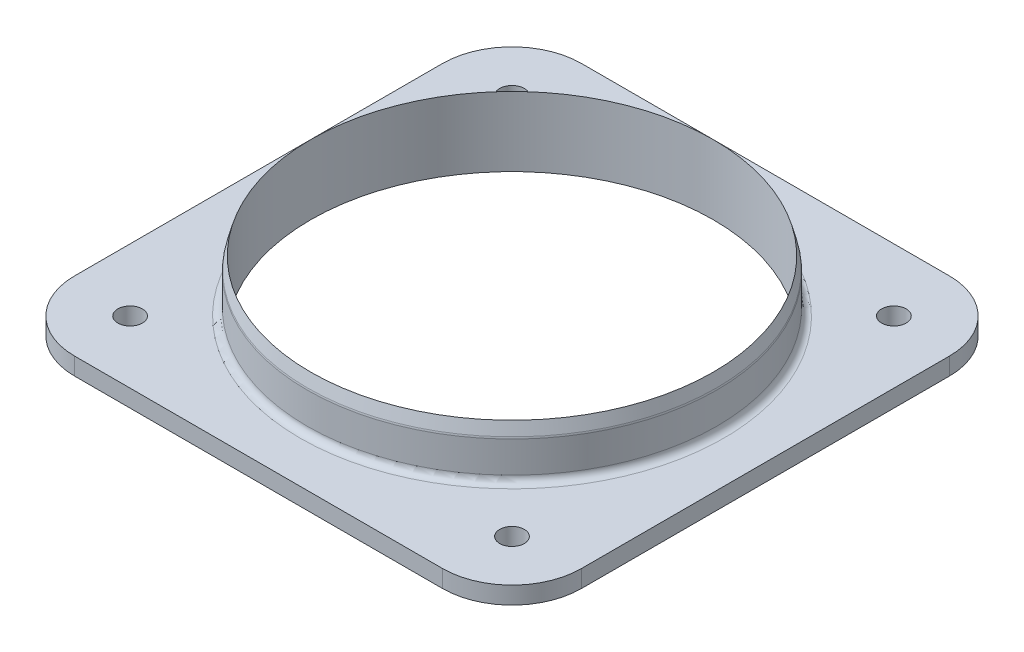
ISO-10303-21;
HEADER;
FILE_DESCRIPTION(('STEP AP214'),'2;1');
FILE_NAME('part.step','',(''),(''),'','','');
FILE_SCHEMA(('AUTOMOTIVE_DESIGN { 1 0 10303 214 1 1 1 1 }'));
ENDSEC;
DATA;
#1=APPLICATION_CONTEXT('core data for automotive mechanical design processes');
#2=APPLICATION_PROTOCOL_DEFINITION('international standard','automotive_design',2000,#1);
#3=PRODUCT_CONTEXT('',#1,'mechanical');
#4=PRODUCT('Part','Part','',(#3));
#5=PRODUCT_RELATED_PRODUCT_CATEGORY('part','',(#4));
#6=PRODUCT_DEFINITION_FORMATION('','',#4);
#7=PRODUCT_DEFINITION_CONTEXT('part definition',#1,'design');
#8=PRODUCT_DEFINITION('design','',#6,#7);
#9=PRODUCT_DEFINITION_SHAPE('','',#8);
#10=(LENGTH_UNIT() NAMED_UNIT(*) SI_UNIT(.MILLI.,.METRE.));
#11=(NAMED_UNIT(*) PLANE_ANGLE_UNIT() SI_UNIT($,.RADIAN.));
#12=(NAMED_UNIT(*) SI_UNIT($,.STERADIAN.) SOLID_ANGLE_UNIT());
#13=UNCERTAINTY_MEASURE_WITH_UNIT(LENGTH_MEASURE(1.E-05),#10,'distance_accuracy_value','');
#14=(GEOMETRIC_REPRESENTATION_CONTEXT(3) GLOBAL_UNCERTAINTY_ASSIGNED_CONTEXT((#13)) GLOBAL_UNIT_ASSIGNED_CONTEXT((#10,
#11,#12)) REPRESENTATION_CONTEXT('',''));
#15=CARTESIAN_POINT('',(0.,0.,0.));
#16=DIRECTION('',(0.,0.,1.));
#17=DIRECTION('',(1.,0.,0.));
#18=AXIS2_PLACEMENT_3D('',#15,#16,#17);
#19=CARTESIAN_POINT('',(0.,3.175,0.));
#20=DIRECTION('',(0.,1.,0.));
#21=DIRECTION('',(0.,0.,1.));
#22=AXIS2_PLACEMENT_3D('',#19,#20,#21);
#23=PLANE('',#22);
#24=CARTESIAN_POINT('',(0.,3.175,0.));
#25=DIRECTION('',(0.,1.,0.));
#26=DIRECTION('',(0.,0.,1.));
#27=AXIS2_PLACEMENT_3D('',#24,#25,#26);
#28=CIRCLE('',#27,38.735);
#29=CARTESIAN_POINT('',(0.,3.175,38.735));
#30=VERTEX_POINT('',#29);
#31=EDGE_CURVE('E11',#30,#30,#28,.F.);
#32=ORIENTED_EDGE('',*,*,#31,.T.);
#33=EDGE_LOOP('',(#32));
#34=FACE_BOUND('',#33,.T.);
#35=DIRECTION('',(-1.,0.,0.));
#36=VECTOR('',#35,1.);
#37=CARTESIAN_POINT('',(46.355,3.175,-46.355));
#38=LINE('',#37,#36);
#39=CARTESIAN_POINT('',(33.655,3.175,-46.355));
#40=VERTEX_POINT('',#39);
#41=CARTESIAN_POINT('',(-33.655,3.175,-46.355));
#42=VERTEX_POINT('',#41);
#43=EDGE_CURVE('E138',#40,#42,#38,.T.);
#44=ORIENTED_EDGE('',*,*,#43,.T.);
#45=CARTESIAN_POINT('',(-33.655,3.175,-33.655));
#46=DIRECTION('',(0.,1.,0.));
#47=DIRECTION('',(0.,0.,1.));
#48=AXIS2_PLACEMENT_3D('',#45,#46,#47);
#49=CIRCLE('',#48,12.7);
#50=CARTESIAN_POINT('',(-46.355,3.175,-33.655));
#51=VERTEX_POINT('',#50);
#52=EDGE_CURVE('E157',#42,#51,#49,.T.);
#53=ORIENTED_EDGE('',*,*,#52,.T.);
#54=DIRECTION('',(0.,0.,1.));
#55=VECTOR('',#54,1.);
#56=CARTESIAN_POINT('',(-46.355,3.175,46.355));
#57=LINE('',#56,#55);
#58=CARTESIAN_POINT('',(-46.355,3.175,33.655));
#59=VERTEX_POINT('',#58);
#60=EDGE_CURVE('E121',#51,#59,#57,.T.);
#61=ORIENTED_EDGE('',*,*,#60,.T.);
#62=CARTESIAN_POINT('',(-33.655,3.175,33.655));
#63=DIRECTION('',(0.,1.,0.));
#64=DIRECTION('',(0.,0.,1.));
#65=AXIS2_PLACEMENT_3D('',#62,#63,#64);
#66=CIRCLE('',#65,12.7);
#67=CARTESIAN_POINT('',(-33.655,3.175,46.355));
#68=VERTEX_POINT('',#67);
#69=EDGE_CURVE('E155',#59,#68,#66,.T.);
#70=ORIENTED_EDGE('',*,*,#69,.T.);
#71=DIRECTION('',(1.,0.,0.));
#72=VECTOR('',#71,1.);
#73=CARTESIAN_POINT('',(46.355,3.175,46.355));
#74=LINE('',#73,#72);
#75=CARTESIAN_POINT('',(33.655,3.175,46.355));
#76=VERTEX_POINT('',#75);
#77=EDGE_CURVE('E236',#68,#76,#74,.T.);
#78=ORIENTED_EDGE('',*,*,#77,.T.);
#79=CARTESIAN_POINT('',(33.655,3.175,33.655));
#80=DIRECTION('',(0.,1.,0.));
#81=DIRECTION('',(0.,0.,1.));
#82=AXIS2_PLACEMENT_3D('',#79,#80,#81);
#83=CIRCLE('',#82,12.7);
#84=CARTESIAN_POINT('',(46.355,3.175,33.655));
#85=VERTEX_POINT('',#84);
#86=EDGE_CURVE('E56',#76,#85,#83,.T.);
#87=ORIENTED_EDGE('',*,*,#86,.T.);
#88=DIRECTION('',(0.,0.,-1.));
#89=VECTOR('',#88,1.);
#90=CARTESIAN_POINT('',(46.355,3.175,46.355));
#91=LINE('',#90,#89);
#92=CARTESIAN_POINT('',(46.355,3.175,-33.655));
#93=VERTEX_POINT('',#92);
#94=EDGE_CURVE('E237',#85,#93,#91,.T.);
#95=ORIENTED_EDGE('',*,*,#94,.T.);
#96=CARTESIAN_POINT('',(33.655,3.175,-33.655));
#97=DIRECTION('',(0.,1.,0.));
#98=DIRECTION('',(0.,0.,1.));
#99=AXIS2_PLACEMENT_3D('',#96,#97,#98);
#100=CIRCLE('',#99,12.7);
#101=EDGE_CURVE('E152',#93,#40,#100,.T.);
#102=ORIENTED_EDGE('',*,*,#101,.T.);
#103=EDGE_LOOP('',(#44,#53,#61,#70,#78,#87,#95,#102));
#104=FACE_BOUND('',#103,.T.);
#105=CARTESIAN_POINT('',(-34.925,3.175,-34.925));
#106=DIRECTION('',(0.,1.,0.));
#107=DIRECTION('',(0.,0.,1.));
#108=AXIS2_PLACEMENT_3D('',#105,#106,#107);
#109=CIRCLE('',#108,2.25);
#110=CARTESIAN_POINT('',(-34.925,3.175,-32.675));
#111=VERTEX_POINT('',#110);
#112=EDGE_CURVE('E203',#111,#111,#109,.T.);
#113=ORIENTED_EDGE('',*,*,#112,.F.);
#114=EDGE_LOOP('',(#113));
#115=FACE_BOUND('',#114,.T.);
#116=CARTESIAN_POINT('',(34.9250000000001,3.175,-34.9249999999999));
#117=DIRECTION('',(0.,1.,0.));
#118=DIRECTION('',(-1.,0.,0.));
#119=AXIS2_PLACEMENT_3D('',#116,#117,#118);
#120=CIRCLE('',#119,2.25);
#121=CARTESIAN_POINT('',(32.6750000000001,3.175,-34.9249999999999));
#122=VERTEX_POINT('',#121);
#123=EDGE_CURVE('E207',#122,#122,#120,.T.);
#124=ORIENTED_EDGE('',*,*,#123,.F.);
#125=EDGE_LOOP('',(#124));
#126=FACE_BOUND('',#125,.T.);
#127=CARTESIAN_POINT('',(34.925,3.175,34.925));
#128=DIRECTION('',(0.,1.,0.));
#129=DIRECTION('',(0.,0.,-1.));
#130=AXIS2_PLACEMENT_3D('',#127,#128,#129);
#131=CIRCLE('',#130,2.25);
#132=CARTESIAN_POINT('',(34.925,3.175,32.675));
#133=VERTEX_POINT('',#132);
#134=EDGE_CURVE('E211',#133,#133,#131,.T.);
#135=ORIENTED_EDGE('',*,*,#134,.F.);
#136=EDGE_LOOP('',(#135));
#137=FACE_BOUND('',#136,.T.);
#138=CARTESIAN_POINT('',(-34.9250000000004,3.175,34.9249999999996));
#139=DIRECTION('',(0.,1.,0.));
#140=DIRECTION('',(1.,0.,0.));
#141=AXIS2_PLACEMENT_3D('',#138,#139,#140);
#142=CIRCLE('',#141,2.25);
#143=CARTESIAN_POINT('',(-32.6750000000004,3.175,34.9249999999996));
#144=VERTEX_POINT('',#143);
#145=EDGE_CURVE('E214',#144,#144,#142,.T.);
#146=ORIENTED_EDGE('',*,*,#145,.F.);
#147=EDGE_LOOP('',(#146));
#148=FACE_BOUND('',#147,.T.);
#149=ADVANCED_FACE('F34',(#34,#104,#115,#126,#137,#148),#23,.T.);
#150=CARTESIAN_POINT('',(0.,0.,0.));
#151=DIRECTION('',(0.,1.,0.));
#152=DIRECTION('',(0.,0.,1.));
#153=AXIS2_PLACEMENT_3D('',#150,#151,#152);
#154=PLANE('',#153);
#155=CARTESIAN_POINT('',(-34.9250000000004,0.,34.9249999999996));
#156=DIRECTION('',(0.,1.,0.));
#157=DIRECTION('',(1.,0.,0.));
#158=AXIS2_PLACEMENT_3D('',#155,#156,#157);
#159=CIRCLE('',#158,2.25);
#160=CARTESIAN_POINT('',(-32.6750000000004,0.,34.9249999999996));
#161=VERTEX_POINT('',#160);
#162=EDGE_CURVE('E216',#161,#161,#159,.T.);
#163=ORIENTED_EDGE('',*,*,#162,.T.);
#164=EDGE_LOOP('',(#163));
#165=FACE_BOUND('',#164,.T.);
#166=CARTESIAN_POINT('',(34.925,0.,34.925));
#167=DIRECTION('',(0.,1.,0.));
#168=DIRECTION('',(0.,0.,-1.));
#169=AXIS2_PLACEMENT_3D('',#166,#167,#168);
#170=CIRCLE('',#169,2.25);
#171=CARTESIAN_POINT('',(34.925,0.,32.675));
#172=VERTEX_POINT('',#171);
#173=EDGE_CURVE('E224',#172,#172,#170,.T.);
#174=ORIENTED_EDGE('',*,*,#173,.T.);
#175=EDGE_LOOP('',(#174));
#176=FACE_BOUND('',#175,.T.);
#177=CARTESIAN_POINT('',(34.9250000000001,0.,-34.9249999999999));
#178=DIRECTION('',(0.,1.,0.));
#179=DIRECTION('',(-1.,0.,0.));
#180=AXIS2_PLACEMENT_3D('',#177,#178,#179);
#181=CIRCLE('',#180,2.25);
#182=CARTESIAN_POINT('',(32.6750000000001,0.,-34.9249999999999));
#183=VERTEX_POINT('',#182);
#184=EDGE_CURVE('E228',#183,#183,#181,.T.);
#185=ORIENTED_EDGE('',*,*,#184,.T.);
#186=EDGE_LOOP('',(#185));
#187=FACE_BOUND('',#186,.T.);
#188=CARTESIAN_POINT('',(-34.925,0.,-34.925));
#189=DIRECTION('',(0.,1.,0.));
#190=DIRECTION('',(0.,0.,1.));
#191=AXIS2_PLACEMENT_3D('',#188,#189,#190);
#192=CIRCLE('',#191,2.25);
#193=CARTESIAN_POINT('',(-34.925,0.,-32.675));
#194=VERTEX_POINT('',#193);
#195=EDGE_CURVE('E135',#194,#194,#192,.T.);
#196=ORIENTED_EDGE('',*,*,#195,.T.);
#197=EDGE_LOOP('',(#196));
#198=FACE_BOUND('',#197,.T.);
#199=DIRECTION('',(0.,0.,1.));
#200=VECTOR('',#199,1.);
#201=CARTESIAN_POINT('',(-46.355,0.,46.355));
#202=LINE('',#201,#200);
#203=CARTESIAN_POINT('',(-46.355,0.,-33.655));
#204=VERTEX_POINT('',#203);
#205=CARTESIAN_POINT('',(-46.355,0.,33.655));
#206=VERTEX_POINT('',#205);
#207=EDGE_CURVE('E118',#204,#206,#202,.T.);
#208=ORIENTED_EDGE('',*,*,#207,.F.);
#209=CARTESIAN_POINT('',(-33.655,0.,-33.655));
#210=DIRECTION('',(0.,1.,0.));
#211=DIRECTION('',(0.,0.,1.));
#212=AXIS2_PLACEMENT_3D('',#209,#210,#211);
#213=CIRCLE('',#212,12.7);
#214=CARTESIAN_POINT('',(-33.655,0.,-46.355));
#215=VERTEX_POINT('',#214);
#216=EDGE_CURVE('E101',#204,#215,#213,.F.);
#217=ORIENTED_EDGE('',*,*,#216,.T.);
#218=DIRECTION('',(-1.,0.,0.));
#219=VECTOR('',#218,1.);
#220=CARTESIAN_POINT('',(46.355,0.,-46.355));
#221=LINE('',#220,#219);
#222=CARTESIAN_POINT('',(33.655,0.,-46.355));
#223=VERTEX_POINT('',#222);
#224=EDGE_CURVE('E142',#223,#215,#221,.T.);
#225=ORIENTED_EDGE('',*,*,#224,.F.);
#226=CARTESIAN_POINT('',(33.655,0.,-33.655));
#227=DIRECTION('',(0.,1.,0.));
#228=DIRECTION('',(0.,0.,1.));
#229=AXIS2_PLACEMENT_3D('',#226,#227,#228);
#230=CIRCLE('',#229,12.7);
#231=CARTESIAN_POINT('',(46.355,0.,-33.655));
#232=VERTEX_POINT('',#231);
#233=EDGE_CURVE('E122',#223,#232,#230,.F.);
#234=ORIENTED_EDGE('',*,*,#233,.T.);
#235=DIRECTION('',(0.,0.,-1.));
#236=VECTOR('',#235,1.);
#237=CARTESIAN_POINT('',(46.355,0.,46.355));
#238=LINE('',#237,#236);
#239=CARTESIAN_POINT('',(46.355,0.,33.655));
#240=VERTEX_POINT('',#239);
#241=EDGE_CURVE('E132',#240,#232,#238,.T.);
#242=ORIENTED_EDGE('',*,*,#241,.F.);
#243=CARTESIAN_POINT('',(33.655,0.,33.655));
#244=DIRECTION('',(0.,1.,0.));
#245=DIRECTION('',(0.,0.,1.));
#246=AXIS2_PLACEMENT_3D('',#243,#244,#245);
#247=CIRCLE('',#246,12.7);
#248=CARTESIAN_POINT('',(33.655,0.,46.355));
#249=VERTEX_POINT('',#248);
#250=EDGE_CURVE('E146',#240,#249,#247,.F.);
#251=ORIENTED_EDGE('',*,*,#250,.T.);
#252=DIRECTION('',(1.,0.,0.));
#253=VECTOR('',#252,1.);
#254=CARTESIAN_POINT('',(46.355,0.,46.355));
#255=LINE('',#254,#253);
#256=CARTESIAN_POINT('',(-33.655,0.,46.355));
#257=VERTEX_POINT('',#256);
#258=EDGE_CURVE('E128',#257,#249,#255,.T.);
#259=ORIENTED_EDGE('',*,*,#258,.F.);
#260=CARTESIAN_POINT('',(-33.655,0.,33.655));
#261=DIRECTION('',(0.,1.,0.));
#262=DIRECTION('',(0.,0.,1.));
#263=AXIS2_PLACEMENT_3D('',#260,#261,#262);
#264=CIRCLE('',#263,12.7);
#265=EDGE_CURVE('E112',#257,#206,#264,.F.);
#266=ORIENTED_EDGE('',*,*,#265,.T.);
#267=EDGE_LOOP('',(#208,#217,#225,#234,#242,#251,#259,#266));
#268=FACE_BOUND('',#267,.T.);
#269=CARTESIAN_POINT('',(0.,0.,0.));
#270=DIRECTION('',(0.,1.,0.));
#271=DIRECTION('',(0.,0.,1.));
#272=AXIS2_PLACEMENT_3D('',#269,#270,#271);
#273=CIRCLE('',#272,36.83);
#274=CARTESIAN_POINT('',(0.,0.,36.83));
#275=VERTEX_POINT('',#274);
#276=EDGE_CURVE('E129',#275,#275,#273,.T.);
#277=ORIENTED_EDGE('',*,*,#276,.T.);
#278=EDGE_LOOP('',(#277));
#279=FACE_BOUND('',#278,.T.);
#280=ADVANCED_FACE('F125',(#165,#176,#187,#198,#268,#279),#154,.F.);
#281=CARTESIAN_POINT('',(-46.355,3.175,46.355));
#282=DIRECTION('',(1.,0.,0.));
#283=DIRECTION('',(0.,0.,-1.));
#284=AXIS2_PLACEMENT_3D('',#281,#282,#283);
#285=PLANE('',#284);
#286=ORIENTED_EDGE('',*,*,#60,.F.);
#287=DIRECTION('',(0.,-1.,0.));
#288=VECTOR('',#287,1.);
#289=CARTESIAN_POINT('',(-46.355,3.175,-33.655));
#290=LINE('',#289,#288);
#291=EDGE_CURVE('E105',#51,#204,#290,.T.);
#292=ORIENTED_EDGE('',*,*,#291,.T.);
#293=ORIENTED_EDGE('',*,*,#207,.T.);
#294=DIRECTION('',(0.,-1.,0.));
#295=VECTOR('',#294,1.);
#296=CARTESIAN_POINT('',(-46.355,3.175,33.655));
#297=LINE('',#296,#295);
#298=EDGE_CURVE('E123',#206,#59,#297,.F.);
#299=ORIENTED_EDGE('',*,*,#298,.T.);
#300=EDGE_LOOP('',(#286,#292,#293,#299));
#301=FACE_BOUND('',#300,.T.);
#302=ADVANCED_FACE('F117',(#301),#285,.F.);
#303=CARTESIAN_POINT('',(46.355,3.175,46.355));
#304=DIRECTION('',(0.,0.,-1.));
#305=DIRECTION('',(-1.,0.,0.));
#306=AXIS2_PLACEMENT_3D('',#303,#304,#305);
#307=PLANE('',#306);
#308=ORIENTED_EDGE('',*,*,#77,.F.);
#309=DIRECTION('',(0.,-1.,0.));
#310=VECTOR('',#309,1.);
#311=CARTESIAN_POINT('',(-33.655,3.175,46.355));
#312=LINE('',#311,#310);
#313=EDGE_CURVE('E161',#68,#257,#312,.T.);
#314=ORIENTED_EDGE('',*,*,#313,.T.);
#315=ORIENTED_EDGE('',*,*,#258,.T.);
#316=DIRECTION('',(0.,-1.,0.));
#317=VECTOR('',#316,1.);
#318=CARTESIAN_POINT('',(33.655,3.175,46.355));
#319=LINE('',#318,#317);
#320=EDGE_CURVE('E159',#249,#76,#319,.F.);
#321=ORIENTED_EDGE('',*,*,#320,.T.);
#322=EDGE_LOOP('',(#308,#314,#315,#321));
#323=FACE_BOUND('',#322,.T.);
#324=ADVANCED_FACE('F251',(#323),#307,.F.);
#325=CARTESIAN_POINT('',(46.355,3.175,46.355));
#326=DIRECTION('',(-1.,0.,0.));
#327=DIRECTION('',(0.,0.,1.));
#328=AXIS2_PLACEMENT_3D('',#325,#326,#327);
#329=PLANE('',#328);
#330=ORIENTED_EDGE('',*,*,#94,.F.);
#331=DIRECTION('',(0.,-1.,0.));
#332=VECTOR('',#331,1.);
#333=CARTESIAN_POINT('',(46.355,3.175,33.655));
#334=LINE('',#333,#332);
#335=EDGE_CURVE('E165',#85,#240,#334,.T.);
#336=ORIENTED_EDGE('',*,*,#335,.T.);
#337=ORIENTED_EDGE('',*,*,#241,.T.);
#338=DIRECTION('',(0.,-1.,0.));
#339=VECTOR('',#338,1.);
#340=CARTESIAN_POINT('',(46.355,3.175,-33.655));
#341=LINE('',#340,#339);
#342=EDGE_CURVE('E49',#232,#93,#341,.F.);
#343=ORIENTED_EDGE('',*,*,#342,.T.);
#344=EDGE_LOOP('',(#330,#336,#337,#343));
#345=FACE_BOUND('',#344,.T.);
#346=ADVANCED_FACE('F245',(#345),#329,.F.);
#347=CARTESIAN_POINT('',(46.355,3.175,-46.355));
#348=DIRECTION('',(0.,0.,1.));
#349=DIRECTION('',(1.,0.,0.));
#350=AXIS2_PLACEMENT_3D('',#347,#348,#349);
#351=PLANE('',#350);
#352=ORIENTED_EDGE('',*,*,#224,.T.);
#353=DIRECTION('',(0.,-1.,0.));
#354=VECTOR('',#353,1.);
#355=CARTESIAN_POINT('',(-33.655,3.175,-46.355));
#356=LINE('',#355,#354);
#357=EDGE_CURVE('E106',#215,#42,#356,.F.);
#358=ORIENTED_EDGE('',*,*,#357,.T.);
#359=ORIENTED_EDGE('',*,*,#43,.F.);
#360=DIRECTION('',(0.,-1.,0.));
#361=VECTOR('',#360,1.);
#362=CARTESIAN_POINT('',(33.655,3.175,-46.355));
#363=LINE('',#362,#361);
#364=EDGE_CURVE('E111',#40,#223,#363,.T.);
#365=ORIENTED_EDGE('',*,*,#364,.T.);
#366=EDGE_LOOP('',(#352,#358,#359,#365));
#367=FACE_BOUND('',#366,.T.);
#368=ADVANCED_FACE('F243',(#367),#351,.F.);
#369=CARTESIAN_POINT('',(0.,3.175,0.));
#370=DIRECTION('',(0.,-1.,0.));
#371=DIRECTION('',(0.,0.,-1.));
#372=AXIS2_PLACEMENT_3D('',#369,#370,#371);
#373=CYLINDRICAL_SURFACE('',#372,36.83);
#374=ORIENTED_EDGE('',*,*,#276,.F.);
#375=EDGE_LOOP('',(#374));
#376=FACE_BOUND('',#375,.T.);
#377=CARTESIAN_POINT('',(0.,12.6999999999997,0.));
#378=DIRECTION('',(0.,-1.,0.));
#379=DIRECTION('',(1.,0.,0.));
#380=AXIS2_PLACEMENT_3D('',#377,#378,#379);
#381=CIRCLE('',#380,36.83);
#382=CARTESIAN_POINT('',(36.83,12.6999999999998,0.));
#383=VERTEX_POINT('',#382);
#384=EDGE_CURVE('E217',#383,#383,#381,.T.);
#385=ORIENTED_EDGE('',*,*,#384,.F.);
#386=EDGE_LOOP('',(#385));
#387=FACE_BOUND('',#386,.T.);
#388=ADVANCED_FACE('F303',(#376,#387),#373,.F.);
#389=CARTESIAN_POINT('',(-34.925,0.,-34.925));
#390=DIRECTION('',(0.,1.,0.));
#391=DIRECTION('',(0.,0.,1.));
#392=AXIS2_PLACEMENT_3D('',#389,#390,#391);
#393=CYLINDRICAL_SURFACE('',#392,2.25);
#394=ORIENTED_EDGE('',*,*,#195,.F.);
#395=EDGE_LOOP('',(#394));
#396=FACE_BOUND('',#395,.T.);
#397=ORIENTED_EDGE('',*,*,#112,.T.);
#398=EDGE_LOOP('',(#397));
#399=FACE_BOUND('',#398,.T.);
#400=ADVANCED_FACE('F309',(#396,#399),#393,.F.);
#401=CARTESIAN_POINT('',(34.9250000000001,0.,-34.9249999999999));
#402=DIRECTION('',(0.,1.,0.));
#403=DIRECTION('',(0.,0.,1.));
#404=AXIS2_PLACEMENT_3D('',#401,#402,#403);
#405=CYLINDRICAL_SURFACE('',#404,2.25);
#406=ORIENTED_EDGE('',*,*,#184,.F.);
#407=EDGE_LOOP('',(#406));
#408=FACE_BOUND('',#407,.T.);
#409=ORIENTED_EDGE('',*,*,#123,.T.);
#410=EDGE_LOOP('',(#409));
#411=FACE_BOUND('',#410,.T.);
#412=ADVANCED_FACE('F352',(#408,#411),#405,.F.);
#413=CARTESIAN_POINT('',(34.925,0.,34.925));
#414=DIRECTION('',(0.,1.,0.));
#415=DIRECTION('',(0.,0.,1.));
#416=AXIS2_PLACEMENT_3D('',#413,#414,#415);
#417=CYLINDRICAL_SURFACE('',#416,2.25);
#418=ORIENTED_EDGE('',*,*,#173,.F.);
#419=EDGE_LOOP('',(#418));
#420=FACE_BOUND('',#419,.T.);
#421=ORIENTED_EDGE('',*,*,#134,.T.);
#422=EDGE_LOOP('',(#421));
#423=FACE_BOUND('',#422,.T.);
#424=ADVANCED_FACE('F342',(#420,#423),#417,.F.);
#425=CARTESIAN_POINT('',(-34.9250000000004,0.,34.9249999999996));
#426=DIRECTION('',(0.,1.,0.));
#427=DIRECTION('',(0.,0.,1.));
#428=AXIS2_PLACEMENT_3D('',#425,#426,#427);
#429=CYLINDRICAL_SURFACE('',#428,2.25);
#430=ORIENTED_EDGE('',*,*,#162,.F.);
#431=EDGE_LOOP('',(#430));
#432=FACE_BOUND('',#431,.T.);
#433=ORIENTED_EDGE('',*,*,#145,.T.);
#434=EDGE_LOOP('',(#433));
#435=FACE_BOUND('',#434,.T.);
#436=ADVANCED_FACE('F263',(#432,#435),#429,.F.);
#437=CARTESIAN_POINT('',(-33.655,3.175,-33.655));
#438=DIRECTION('',(0.,-1.,0.));
#439=DIRECTION('',(0.,0.,-1.));
#440=AXIS2_PLACEMENT_3D('',#437,#438,#439);
#441=CYLINDRICAL_SURFACE('',#440,12.7);
#442=ORIENTED_EDGE('',*,*,#52,.F.);
#443=ORIENTED_EDGE('',*,*,#357,.F.);
#444=ORIENTED_EDGE('',*,*,#216,.F.);
#445=ORIENTED_EDGE('',*,*,#291,.F.);
#446=EDGE_LOOP('',(#442,#443,#444,#445));
#447=FACE_BOUND('',#446,.T.);
#448=ADVANCED_FACE('F104',(#447),#441,.T.);
#449=CARTESIAN_POINT('',(-33.655,3.175,33.655));
#450=DIRECTION('',(0.,-1.,0.));
#451=DIRECTION('',(0.,0.,-1.));
#452=AXIS2_PLACEMENT_3D('',#449,#450,#451);
#453=CYLINDRICAL_SURFACE('',#452,12.7);
#454=ORIENTED_EDGE('',*,*,#69,.F.);
#455=ORIENTED_EDGE('',*,*,#298,.F.);
#456=ORIENTED_EDGE('',*,*,#265,.F.);
#457=ORIENTED_EDGE('',*,*,#313,.F.);
#458=EDGE_LOOP('',(#454,#455,#456,#457));
#459=FACE_BOUND('',#458,.T.);
#460=ADVANCED_FACE('F255',(#459),#453,.T.);
#461=CARTESIAN_POINT('',(33.655,3.175,33.655));
#462=DIRECTION('',(0.,-1.,0.));
#463=DIRECTION('',(0.,0.,-1.));
#464=AXIS2_PLACEMENT_3D('',#461,#462,#463);
#465=CYLINDRICAL_SURFACE('',#464,12.7);
#466=ORIENTED_EDGE('',*,*,#86,.F.);
#467=ORIENTED_EDGE('',*,*,#320,.F.);
#468=ORIENTED_EDGE('',*,*,#250,.F.);
#469=ORIENTED_EDGE('',*,*,#335,.F.);
#470=EDGE_LOOP('',(#466,#467,#468,#469));
#471=FACE_BOUND('',#470,.T.);
#472=ADVANCED_FACE('F247',(#471),#465,.T.);
#473=CARTESIAN_POINT('',(33.655,3.175,-33.655));
#474=DIRECTION('',(0.,-1.,0.));
#475=DIRECTION('',(0.,0.,-1.));
#476=AXIS2_PLACEMENT_3D('',#473,#474,#475);
#477=CYLINDRICAL_SURFACE('',#476,12.7);
#478=ORIENTED_EDGE('',*,*,#101,.F.);
#479=ORIENTED_EDGE('',*,*,#342,.F.);
#480=ORIENTED_EDGE('',*,*,#233,.F.);
#481=ORIENTED_EDGE('',*,*,#364,.F.);
#482=EDGE_LOOP('',(#478,#479,#480,#481));
#483=FACE_BOUND('',#482,.T.);
#484=ADVANCED_FACE('F187',(#483),#477,.T.);
#485=CARTESIAN_POINT('',(3.49148133884313E-12,-1000.,0.));
#486=DIRECTION('',(0.,-1.,0.));
#487=DIRECTION('',(1.,0.,0.));
#488=AXIS2_PLACEMENT_3D('',#485,#486,#487);
#489=CYLINDRICAL_SURFACE('',#488,37.465);
#490=CARTESIAN_POINT('',(0.,10.1629490652575,0.));
#491=DIRECTION('',(0.,1.,0.));
#492=DIRECTION('',(-1.,0.,0.));
#493=AXIS2_PLACEMENT_3D('',#490,#491,#492);
#494=CIRCLE('',#493,37.465);
#495=CARTESIAN_POINT('',(-37.4650000000001,10.1629490652574,0.));
#496=VERTEX_POINT('',#495);
#497=EDGE_CURVE('E171',#496,#496,#494,.F.);
#498=ORIENTED_EDGE('',*,*,#497,.T.);
#499=EDGE_LOOP('',(#498));
#500=FACE_BOUND('',#499,.T.);
#501=CARTESIAN_POINT('',(0.,4.44500000000003,0.));
#502=DIRECTION('',(0.,1.,0.));
#503=DIRECTION('',(0.,0.,1.));
#504=AXIS2_PLACEMENT_3D('',#501,#502,#503);
#505=CIRCLE('',#504,37.465);
#506=CARTESIAN_POINT('',(0.,4.44500000000003,37.465));
#507=VERTEX_POINT('',#506);
#508=EDGE_CURVE('E168',#507,#507,#505,.T.);
#509=ORIENTED_EDGE('',*,*,#508,.T.);
#510=EDGE_LOOP('',(#509));
#511=FACE_BOUND('',#510,.T.);
#512=ADVANCED_FACE('F184',(#500,#511),#489,.T.);
#513=CARTESIAN_POINT('',(0.,12.6999999999997,0.));
#514=DIRECTION('',(0.,-1.,0.));
#515=DIRECTION('',(1.,0.,0.));
#516=AXIS2_PLACEMENT_3D('',#513,#514,#515);
#517=CONICAL_SURFACE('',#516,36.83,0.261799387799152);
#518=CARTESIAN_POINT('',(0.,10.4916492525377,0.));
#519=DIRECTION('',(0.,1.,0.));
#520=DIRECTION('',(-1.,0.,0.));
#521=AXIS2_PLACEMENT_3D('',#518,#519,#520);
#522=CIRCLE('',#521,37.4217257993872);
#523=CARTESIAN_POINT('',(-37.4217257993872,10.4916492525375,0.));
#524=VERTEX_POINT('',#523);
#525=EDGE_CURVE('E42',#524,#524,#522,.T.);
#526=ORIENTED_EDGE('',*,*,#525,.T.);
#527=EDGE_LOOP('',(#526));
#528=FACE_BOUND('',#527,.T.);
#529=ORIENTED_EDGE('',*,*,#384,.T.);
#530=EDGE_LOOP('',(#529));
#531=FACE_BOUND('',#530,.T.);
#532=ADVANCED_FACE('F176',(#528,#531),#517,.T.);
#533=CARTESIAN_POINT('',(0.,10.1629490652575,0.));
#534=DIRECTION('',(0.,1.,0.));
#535=DIRECTION('',(-1.,0.,0.));
#536=AXIS2_PLACEMENT_3D('',#533,#534,#535);
#537=TOROIDAL_SURFACE('',#536,36.195,1.27);
#538=ORIENTED_EDGE('',*,*,#525,.F.);
#539=EDGE_LOOP('',(#538));
#540=FACE_BOUND('',#539,.T.);
#541=ORIENTED_EDGE('',*,*,#497,.F.);
#542=EDGE_LOOP('',(#541));
#543=FACE_BOUND('',#542,.T.);
#544=ADVANCED_FACE('F179',(#540,#543),#537,.T.);
#545=CARTESIAN_POINT('',(0.,4.44500000000003,0.));
#546=DIRECTION('',(0.,1.,0.));
#547=DIRECTION('',(0.,0.,1.));
#548=AXIS2_PLACEMENT_3D('',#545,#546,#547);
#549=TOROIDAL_SURFACE('',#548,38.735,1.27);
#550=ORIENTED_EDGE('',*,*,#508,.F.);
#551=EDGE_LOOP('',(#550));
#552=FACE_BOUND('',#551,.T.);
#553=ORIENTED_EDGE('',*,*,#31,.F.);
#554=EDGE_LOOP('',(#553));
#555=FACE_BOUND('',#554,.T.);
#556=ADVANCED_FACE('F36',(#552,#555),#549,.F.);
#557=CLOSED_SHELL('',(#149,#280,#302,#324,#346,#368,#388,#400,#412,#424,#436,#448,#460,#472,
#484,#512,#532,#544,#556));
#558=MANIFOLD_SOLID_BREP('B2',#557);
#559=ADVANCED_BREP_SHAPE_REPRESENTATION('',(#18,#558),#14);
#560=SHAPE_DEFINITION_REPRESENTATION(#9,#559);
ENDSEC;
END-ISO-10303-21;
